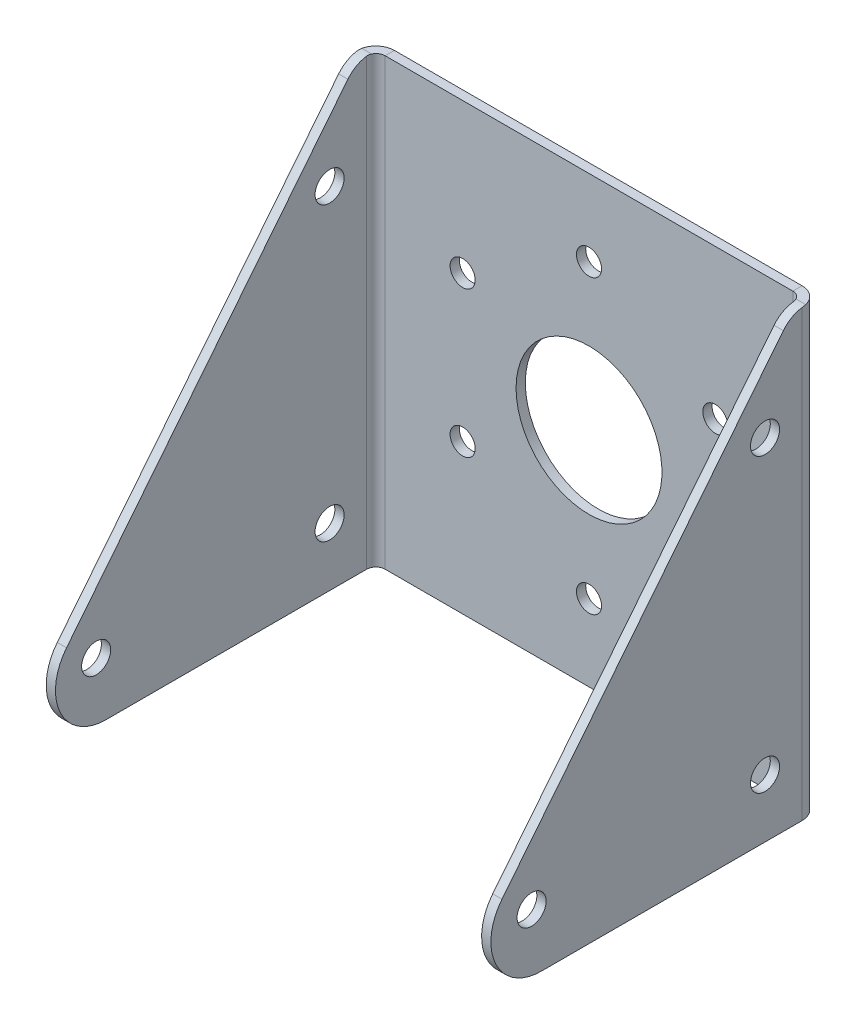
ISO-10303-21;
HEADER;
FILE_DESCRIPTION(('STEP AP214'),'2;1');
FILE_NAME('part.step','',(''),(''),'','','');
FILE_SCHEMA(('AUTOMOTIVE_DESIGN { 1 0 10303 214 1 1 1 1 }'));
ENDSEC;
DATA;
#1=APPLICATION_CONTEXT('core data for automotive mechanical design processes');
#2=APPLICATION_PROTOCOL_DEFINITION('international standard','automotive_design',2000,#1);
#3=PRODUCT_CONTEXT('',#1,'mechanical');
#4=PRODUCT('Part','Part','',(#3));
#5=PRODUCT_RELATED_PRODUCT_CATEGORY('part','',(#4));
#6=PRODUCT_DEFINITION_FORMATION('','',#4);
#7=PRODUCT_DEFINITION_CONTEXT('part definition',#1,'design');
#8=PRODUCT_DEFINITION('design','',#6,#7);
#9=PRODUCT_DEFINITION_SHAPE('','',#8);
#10=(LENGTH_UNIT() NAMED_UNIT(*) SI_UNIT(.MILLI.,.METRE.));
#11=(NAMED_UNIT(*) PLANE_ANGLE_UNIT() SI_UNIT($,.RADIAN.));
#12=(NAMED_UNIT(*) SI_UNIT($,.STERADIAN.) SOLID_ANGLE_UNIT());
#13=UNCERTAINTY_MEASURE_WITH_UNIT(LENGTH_MEASURE(1.E-05),#10,'distance_accuracy_value','');
#14=(GEOMETRIC_REPRESENTATION_CONTEXT(3) GLOBAL_UNCERTAINTY_ASSIGNED_CONTEXT((#13)) GLOBAL_UNIT_ASSIGNED_CONTEXT((#10,
#11,#12)) REPRESENTATION_CONTEXT('',''));
#15=CARTESIAN_POINT('',(0.,0.,0.));
#16=DIRECTION('',(0.,0.,1.));
#17=DIRECTION('',(1.,0.,0.));
#18=AXIS2_PLACEMENT_3D('',#15,#16,#17);
#19=CARTESIAN_POINT('',(-38.1000000000003,-38.1,78.4125));
#20=DIRECTION('',(0.,1.,0.));
#21=DIRECTION('',(0.,0.,1.));
#22=AXIS2_PLACEMENT_3D('',#19,#20,#21);
#23=PLANE('',#22);
#24=DIRECTION('',(-1.,0.,0.));
#25=VECTOR('',#24,1.);
#26=CARTESIAN_POINT('',(38.1000000000004,-38.1,46.2553130337973));
#27=LINE('',#26,#25);
#28=CARTESIAN_POINT('',(-36.5125000000002,-38.1,46.2553130337971));
#29=VERTEX_POINT('',#28);
#30=CARTESIAN_POINT('',(-38.1000000000002,-38.1,46.2553130337971));
#31=VERTEX_POINT('',#30);
#32=EDGE_CURVE('E277',#29,#31,#27,.T.);
#33=ORIENTED_EDGE('',*,*,#32,.T.);
#34=DIRECTION('',(0.,0.,1.));
#35=VECTOR('',#34,1.);
#36=CARTESIAN_POINT('',(-38.1,-38.1,-1.33661720332755E-13));
#37=LINE('',#36,#35);
#38=CARTESIAN_POINT('',(-38.1,-38.1,1.58749999999999));
#39=VERTEX_POINT('',#38);
#40=EDGE_CURVE('E367',#39,#31,#37,.T.);
#41=ORIENTED_EDGE('',*,*,#40,.F.);
#42=DIRECTION('',(1.,0.,0.));
#43=VECTOR('',#42,1.);
#44=CARTESIAN_POINT('',(-36.5125,-38.1,1.58749999999999));
#45=LINE('',#44,#43);
#46=CARTESIAN_POINT('',(-36.5125,-38.1,1.58749999999999));
#47=VERTEX_POINT('',#46);
#48=EDGE_CURVE('E380',#47,#39,#45,.F.);
#49=ORIENTED_EDGE('',*,*,#48,.F.);
#50=DIRECTION('',(0.,0.,-1.));
#51=VECTOR('',#50,1.);
#52=CARTESIAN_POINT('',(-36.5125000000003,-38.1,78.4125));
#53=LINE('',#52,#51);
#54=EDGE_CURVE('E372',#47,#29,#53,.F.);
#55=ORIENTED_EDGE('',*,*,#54,.T.);
#56=EDGE_LOOP('',(#33,#41,#49,#55));
#57=FACE_BOUND('',#56,.T.);
#58=ADVANCED_FACE('F140',(#57),#23,.F.);
#59=CARTESIAN_POINT('',(-38.1,0.,-1.37033272798737E-13));
#60=DIRECTION('',(1.,0.,0.));
#61=DIRECTION('',(0.,0.,-1.));
#62=AXIS2_PLACEMENT_3D('',#59,#60,#61);
#63=PLANE('',#62);
#64=CARTESIAN_POINT('',(-38.1,-28.1,7.93750000000003));
#65=DIRECTION('',(-1.,0.,0.));
#66=DIRECTION('',(0.,0.,1.));
#67=AXIS2_PLACEMENT_3D('',#64,#65,#66);
#68=CIRCLE('',#67,2.48919999999996);
#69=CARTESIAN_POINT('',(-38.1,-28.1,10.4267));
#70=VERTEX_POINT('',#69);
#71=EDGE_CURVE('E570',#70,#70,#68,.T.);
#72=ORIENTED_EDGE('',*,*,#71,.F.);
#73=EDGE_LOOP('',(#72));
#74=FACE_BOUND('',#73,.T.);
#75=DIRECTION('',(0.,-0.78086880944303,0.624695047554424));
#76=VECTOR('',#75,1.);
#77=CARTESIAN_POINT('',(-38.1000000000001,16.4788104920307,20.5985131150382));
#78=LINE('',#77,#76);
#79=CARTESIAN_POINT('',(-38.1,36.2234752377721,4.80278131844511));
#80=VERTEX_POINT('',#79);
#81=CARTESIAN_POINT('',(-38.1000000000002,-24.0394821908962,53.0131472613798));
#82=VERTEX_POINT('',#81);
#83=EDGE_CURVE('E291',#80,#82,#78,.T.);
#84=ORIENTED_EDGE('',*,*,#83,.F.);
#85=CARTESIAN_POINT('',(-38.1,33.1,0.898437271229962));
#86=DIRECTION('',(1.,0.,0.));
#87=DIRECTION('',(0.,0.,-1.));
#88=AXIS2_PLACEMENT_3D('',#85,#86,#87);
#89=CIRCLE('',#88,5.);
#90=CARTESIAN_POINT('',(-38.1,38.0522916468863,1.58749999999999));
#91=VERTEX_POINT('',#90);
#92=EDGE_CURVE('E450',#80,#91,#89,.F.);
#93=ORIENTED_EDGE('',*,*,#92,.T.);
#94=DIRECTION('',(0.,-1.,0.));
#95=VECTOR('',#94,1.);
#96=CARTESIAN_POINT('',(-38.1,38.1,1.58749999999999));
#97=LINE('',#96,#95);
#98=EDGE_CURVE('E376',#39,#91,#97,.F.);
#99=ORIENTED_EDGE('',*,*,#98,.F.);
#100=ORIENTED_EDGE('',*,*,#40,.T.);
#101=CARTESIAN_POINT('',(-38.1000000000002,-29.4457495729624,46.2553130337971));
#102=DIRECTION('',(-1.,0.,0.));
#103=DIRECTION('',(0.,0.,1.));
#104=AXIS2_PLACEMENT_3D('',#101,#102,#103);
#105=CIRCLE('',#104,8.65425042703763);
#106=EDGE_CURVE('E267',#82,#31,#105,.F.);
#107=ORIENTED_EDGE('',*,*,#106,.F.);
#108=EDGE_LOOP('',(#84,#93,#99,#100,#107));
#109=FACE_BOUND('',#108,.T.);
#110=CARTESIAN_POINT('',(-38.1,21.9,7.93750000000003));
#111=DIRECTION('',(-1.,0.,0.));
#112=DIRECTION('',(0.,0.,1.));
#113=AXIS2_PLACEMENT_3D('',#110,#111,#112);
#114=CIRCLE('',#113,2.48919999999996);
#115=CARTESIAN_POINT('',(-38.1,21.9,10.4267));
#116=VERTEX_POINT('',#115);
#117=EDGE_CURVE('E583',#116,#116,#114,.T.);
#118=ORIENTED_EDGE('',*,*,#117,.F.);
#119=EDGE_LOOP('',(#118));
#120=FACE_BOUND('',#119,.T.);
#121=CARTESIAN_POINT('',(-38.1000000000002,-28.1,47.9375));
#122=DIRECTION('',(-1.,0.,0.));
#123=DIRECTION('',(0.,0.,1.));
#124=AXIS2_PLACEMENT_3D('',#121,#122,#123);
#125=CIRCLE('',#124,2.48919999999997);
#126=CARTESIAN_POINT('',(-38.1000000000002,-28.1,50.4267));
#127=VERTEX_POINT('',#126);
#128=EDGE_CURVE('E571',#127,#127,#125,.T.);
#129=ORIENTED_EDGE('',*,*,#128,.F.);
#130=EDGE_LOOP('',(#129));
#131=FACE_BOUND('',#130,.T.);
#132=ADVANCED_FACE('F516',(#74,#109,#120,#131),#63,.F.);
#133=CARTESIAN_POINT('',(-36.5125,0.,-1.31490546173324E-13));
#134=DIRECTION('',(1.,0.,0.));
#135=DIRECTION('',(0.,0.,-1.));
#136=AXIS2_PLACEMENT_3D('',#133,#134,#135);
#137=PLANE('',#136);
#138=DIRECTION('',(0.,-1.,0.));
#139=VECTOR('',#138,1.);
#140=CARTESIAN_POINT('',(-36.5125,38.1,1.58749999999999));
#141=LINE('',#140,#139);
#142=CARTESIAN_POINT('',(-36.5125,38.0522916468863,1.58749999999999));
#143=VERTEX_POINT('',#142);
#144=EDGE_CURVE('E363',#143,#47,#141,.T.);
#145=ORIENTED_EDGE('',*,*,#144,.F.);
#146=CARTESIAN_POINT('',(-36.5125,33.1,0.898437271229968));
#147=DIRECTION('',(1.,0.,0.));
#148=DIRECTION('',(0.,0.,-1.));
#149=AXIS2_PLACEMENT_3D('',#146,#147,#148);
#150=CIRCLE('',#149,5.);
#151=CARTESIAN_POINT('',(-36.5125,36.2234752377721,4.80278131844512));
#152=VERTEX_POINT('',#151);
#153=EDGE_CURVE('E483',#143,#152,#150,.T.);
#154=ORIENTED_EDGE('',*,*,#153,.T.);
#155=DIRECTION('',(0.,0.78086880944303,-0.624695047554424));
#156=VECTOR('',#155,1.);
#157=CARTESIAN_POINT('',(-36.5125000000001,16.4788104920307,20.5985131150383));
#158=LINE('',#157,#156);
#159=CARTESIAN_POINT('',(-36.5125000000001,-24.0394821908962,53.0131472613798));
#160=VERTEX_POINT('',#159);
#161=EDGE_CURVE('E302',#160,#152,#158,.T.);
#162=ORIENTED_EDGE('',*,*,#161,.F.);
#163=CARTESIAN_POINT('',(-36.5125000000002,-29.4457495729624,46.2553130337971));
#164=DIRECTION('',(1.,0.,0.));
#165=DIRECTION('',(0.,0.,-1.));
#166=AXIS2_PLACEMENT_3D('',#163,#164,#165);
#167=CIRCLE('',#166,8.65425042703763);
#168=EDGE_CURVE('E298',#29,#160,#167,.F.);
#169=ORIENTED_EDGE('',*,*,#168,.F.);
#170=ORIENTED_EDGE('',*,*,#54,.F.);
#171=EDGE_LOOP('',(#145,#154,#162,#169,#170));
#172=FACE_BOUND('',#171,.T.);
#173=CARTESIAN_POINT('',(-36.5125,21.9,7.93750000000003));
#174=DIRECTION('',(1.,0.,0.));
#175=DIRECTION('',(0.,0.,-1.));
#176=AXIS2_PLACEMENT_3D('',#173,#174,#175);
#177=CIRCLE('',#176,2.48919999999996);
#178=CARTESIAN_POINT('',(-36.5125,21.9,5.44830000000007));
#179=VERTEX_POINT('',#178);
#180=EDGE_CURVE('E307',#179,#179,#177,.T.);
#181=ORIENTED_EDGE('',*,*,#180,.F.);
#182=EDGE_LOOP('',(#181));
#183=FACE_BOUND('',#182,.T.);
#184=CARTESIAN_POINT('',(-36.5125,-28.1,7.93750000000003));
#185=DIRECTION('',(1.,0.,0.));
#186=DIRECTION('',(0.,0.,-1.));
#187=AXIS2_PLACEMENT_3D('',#184,#185,#186);
#188=CIRCLE('',#187,2.48919999999996);
#189=CARTESIAN_POINT('',(-36.5125,-28.1,5.44830000000007));
#190=VERTEX_POINT('',#189);
#191=EDGE_CURVE('E312',#190,#190,#188,.T.);
#192=ORIENTED_EDGE('',*,*,#191,.F.);
#193=EDGE_LOOP('',(#192));
#194=FACE_BOUND('',#193,.T.);
#195=CARTESIAN_POINT('',(-36.5125000000002,-28.1,47.9375));
#196=DIRECTION('',(1.,0.,0.));
#197=DIRECTION('',(0.,0.,-1.));
#198=AXIS2_PLACEMENT_3D('',#195,#196,#197);
#199=CIRCLE('',#198,2.48919999999997);
#200=CARTESIAN_POINT('',(-36.5125000000002,-28.1,45.4483000000001));
#201=VERTEX_POINT('',#200);
#202=EDGE_CURVE('E317',#201,#201,#199,.T.);
#203=ORIENTED_EDGE('',*,*,#202,.F.);
#204=EDGE_LOOP('',(#203));
#205=FACE_BOUND('',#204,.T.);
#206=ADVANCED_FACE('F521',(#172,#183,#194,#205),#137,.T.);
#207=CARTESIAN_POINT('',(38.1,-38.1,0.));
#208=DIRECTION('',(0.,1.,0.));
#209=DIRECTION('',(0.,0.,1.));
#210=AXIS2_PLACEMENT_3D('',#207,#208,#209);
#211=PLANE('',#210);
#212=CARTESIAN_POINT('',(38.1000000000004,-38.1,46.2553130337973));
#213=VERTEX_POINT('',#212);
#214=CARTESIAN_POINT('',(36.5125000000002,-38.1,46.2553130337973));
#215=VERTEX_POINT('',#214);
#216=EDGE_CURVE('E282',#213,#215,#27,.T.);
#217=ORIENTED_EDGE('',*,*,#216,.T.);
#218=DIRECTION('',(0.,0.,1.));
#219=VECTOR('',#218,1.);
#220=CARTESIAN_POINT('',(36.5125,-38.1,0.));
#221=LINE('',#220,#219);
#222=CARTESIAN_POINT('',(36.5125,-38.1,1.58749999999999));
#223=VERTEX_POINT('',#222);
#224=EDGE_CURVE('E326',#215,#223,#221,.F.);
#225=ORIENTED_EDGE('',*,*,#224,.T.);
#226=DIRECTION('',(-1.,0.,0.));
#227=VECTOR('',#226,1.);
#228=CARTESIAN_POINT('',(38.1,-38.1,1.58749999999999));
#229=LINE('',#228,#227);
#230=CARTESIAN_POINT('',(38.1,-38.1,1.58749999999999));
#231=VERTEX_POINT('',#230);
#232=EDGE_CURVE('E321',#223,#231,#229,.F.);
#233=ORIENTED_EDGE('',*,*,#232,.T.);
#234=DIRECTION('',(0.,0.,-1.));
#235=VECTOR('',#234,1.);
#236=CARTESIAN_POINT('',(38.1,-38.1,-1.33661720332755E-13));
#237=LINE('',#236,#235);
#238=EDGE_CURVE('E322',#213,#231,#237,.T.);
#239=ORIENTED_EDGE('',*,*,#238,.F.);
#240=EDGE_LOOP('',(#217,#225,#233,#239));
#241=FACE_BOUND('',#240,.T.);
#242=ADVANCED_FACE('F527',(#241),#211,.F.);
#243=CARTESIAN_POINT('',(38.1,0.,-1.37033272798737E-13));
#244=DIRECTION('',(-1.,0.,0.));
#245=DIRECTION('',(0.,0.,1.));
#246=AXIS2_PLACEMENT_3D('',#243,#244,#245);
#247=PLANE('',#246);
#248=CARTESIAN_POINT('',(38.1000000000005,-28.1,7.93750000000029));
#249=DIRECTION('',(-1.,0.,0.));
#250=DIRECTION('',(0.,0.,1.));
#251=AXIS2_PLACEMENT_3D('',#248,#249,#250);
#252=CIRCLE('',#251,2.48919999999996);
#253=CARTESIAN_POINT('',(38.1000000000005,-28.1,10.4267000000003));
#254=VERTEX_POINT('',#253);
#255=EDGE_CURVE('E585',#254,#254,#252,.T.);
#256=ORIENTED_EDGE('',*,*,#255,.T.);
#257=EDGE_LOOP('',(#256));
#258=FACE_BOUND('',#257,.T.);
#259=DIRECTION('',(0.,1.,0.));
#260=VECTOR('',#259,1.);
#261=CARTESIAN_POINT('',(38.1,-38.1,1.58749999999999));
#262=LINE('',#261,#260);
#263=CARTESIAN_POINT('',(38.1,38.0522916468864,1.58749999999999));
#264=VERTEX_POINT('',#263);
#265=EDGE_CURVE('E328',#264,#231,#262,.F.);
#266=ORIENTED_EDGE('',*,*,#265,.F.);
#267=CARTESIAN_POINT('',(38.1,33.1,0.898437271230224));
#268=DIRECTION('',(-1.,0.,0.));
#269=DIRECTION('',(0.,0.,1.));
#270=AXIS2_PLACEMENT_3D('',#267,#268,#269);
#271=CIRCLE('',#270,5.);
#272=CARTESIAN_POINT('',(38.1000000000005,36.2234752377721,4.80278131844537));
#273=VERTEX_POINT('',#272);
#274=EDGE_CURVE('E13',#264,#273,#271,.F.);
#275=ORIENTED_EDGE('',*,*,#274,.T.);
#276=DIRECTION('',(0.,-0.78086880944303,0.624695047554424));
#277=VECTOR('',#276,1.);
#278=CARTESIAN_POINT('',(38.1000000000005,16.4788104920307,20.5985131150385));
#279=LINE('',#278,#277);
#280=CARTESIAN_POINT('',(38.1000000000004,-24.0394821908962,53.01314726138));
#281=VERTEX_POINT('',#280);
#282=EDGE_CURVE('E254',#273,#281,#279,.T.);
#283=ORIENTED_EDGE('',*,*,#282,.T.);
#284=CARTESIAN_POINT('',(38.1000000000004,-29.4457495729624,46.2553130337973));
#285=DIRECTION('',(-1.,0.,0.));
#286=DIRECTION('',(0.,0.,1.));
#287=AXIS2_PLACEMENT_3D('',#284,#285,#286);
#288=CIRCLE('',#287,8.65425042703763);
#289=EDGE_CURVE('E260',#281,#213,#288,.F.);
#290=ORIENTED_EDGE('',*,*,#289,.T.);
#291=ORIENTED_EDGE('',*,*,#238,.T.);
#292=EDGE_LOOP('',(#266,#275,#283,#290,#291));
#293=FACE_BOUND('',#292,.T.);
#294=CARTESIAN_POINT('',(38.1000000000005,21.9,7.93750000000029));
#295=DIRECTION('',(-1.,0.,0.));
#296=DIRECTION('',(0.,0.,1.));
#297=AXIS2_PLACEMENT_3D('',#294,#295,#296);
#298=CIRCLE('',#297,2.48919999999996);
#299=CARTESIAN_POINT('',(38.1000000000005,21.9,10.4267000000003));
#300=VERTEX_POINT('',#299);
#301=EDGE_CURVE('E294',#300,#300,#298,.T.);
#302=ORIENTED_EDGE('',*,*,#301,.T.);
#303=EDGE_LOOP('',(#302));
#304=FACE_BOUND('',#303,.T.);
#305=CARTESIAN_POINT('',(38.1000000000004,-28.1,47.9375000000003));
#306=DIRECTION('',(-1.,0.,0.));
#307=DIRECTION('',(0.,0.,1.));
#308=AXIS2_PLACEMENT_3D('',#305,#306,#307);
#309=CIRCLE('',#308,2.48919999999997);
#310=CARTESIAN_POINT('',(38.1000000000004,-28.1,50.4267000000003));
#311=VERTEX_POINT('',#310);
#312=EDGE_CURVE('E568',#311,#311,#309,.T.);
#313=ORIENTED_EDGE('',*,*,#312,.T.);
#314=EDGE_LOOP('',(#313));
#315=FACE_BOUND('',#314,.T.);
#316=ADVANCED_FACE('F256',(#258,#293,#304,#315),#247,.F.);
#317=CARTESIAN_POINT('',(36.5125,0.,-1.31490546173324E-13));
#318=DIRECTION('',(-1.,0.,0.));
#319=DIRECTION('',(0.,0.,1.));
#320=AXIS2_PLACEMENT_3D('',#317,#318,#319);
#321=PLANE('',#320);
#322=DIRECTION('',(0.,-0.78086880944303,0.624695047554424));
#323=VECTOR('',#322,1.);
#324=CARTESIAN_POINT('',(36.5125000000001,16.4788104920308,20.5985131150384));
#325=LINE('',#324,#323);
#326=CARTESIAN_POINT('',(36.5125,36.2234752377721,4.80278131844537));
#327=VERTEX_POINT('',#326);
#328=CARTESIAN_POINT('',(36.5125000000002,-24.0394821908961,53.01314726138));
#329=VERTEX_POINT('',#328);
#330=EDGE_CURVE('E273',#327,#329,#325,.T.);
#331=ORIENTED_EDGE('',*,*,#330,.F.);
#332=CARTESIAN_POINT('',(36.5125,33.1,0.898437271230219));
#333=DIRECTION('',(-1.,0.,0.));
#334=DIRECTION('',(0.,0.,1.));
#335=AXIS2_PLACEMENT_3D('',#332,#333,#334);
#336=CIRCLE('',#335,5.);
#337=CARTESIAN_POINT('',(36.5125,38.0522916468864,1.58749999999999));
#338=VERTEX_POINT('',#337);
#339=EDGE_CURVE('E553',#327,#338,#336,.T.);
#340=ORIENTED_EDGE('',*,*,#339,.T.);
#341=DIRECTION('',(0.,1.,0.));
#342=VECTOR('',#341,1.);
#343=CARTESIAN_POINT('',(36.5125,-38.1,1.58749999999999));
#344=LINE('',#343,#342);
#345=EDGE_CURVE('E331',#223,#338,#344,.T.);
#346=ORIENTED_EDGE('',*,*,#345,.F.);
#347=ORIENTED_EDGE('',*,*,#224,.F.);
#348=CARTESIAN_POINT('',(36.5125000000002,-29.4457495729624,46.2553130337973));
#349=DIRECTION('',(-1.,0.,0.));
#350=DIRECTION('',(0.,0.,1.));
#351=AXIS2_PLACEMENT_3D('',#348,#349,#350);
#352=CIRCLE('',#351,8.65425042703763);
#353=EDGE_CURVE('E426',#329,#215,#352,.F.);
#354=ORIENTED_EDGE('',*,*,#353,.F.);
#355=EDGE_LOOP('',(#331,#340,#346,#347,#354));
#356=FACE_BOUND('',#355,.T.);
#357=CARTESIAN_POINT('',(36.5125,21.9,7.93750000000029));
#358=DIRECTION('',(-1.,0.,0.));
#359=DIRECTION('',(0.,0.,1.));
#360=AXIS2_PLACEMENT_3D('',#357,#358,#359);
#361=CIRCLE('',#360,2.48919999999996);
#362=CARTESIAN_POINT('',(36.5125,21.9,10.4267000000003));
#363=VERTEX_POINT('',#362);
#364=EDGE_CURVE('E306',#363,#363,#361,.T.);
#365=ORIENTED_EDGE('',*,*,#364,.F.);
#366=EDGE_LOOP('',(#365));
#367=FACE_BOUND('',#366,.T.);
#368=CARTESIAN_POINT('',(36.5125,-28.1,7.93750000000029));
#369=DIRECTION('',(-1.,0.,0.));
#370=DIRECTION('',(0.,0.,1.));
#371=AXIS2_PLACEMENT_3D('',#368,#369,#370);
#372=CIRCLE('',#371,2.48919999999996);
#373=CARTESIAN_POINT('',(36.5125,-28.1,10.4267000000003));
#374=VERTEX_POINT('',#373);
#375=EDGE_CURVE('E311',#374,#374,#372,.T.);
#376=ORIENTED_EDGE('',*,*,#375,.F.);
#377=EDGE_LOOP('',(#376));
#378=FACE_BOUND('',#377,.T.);
#379=CARTESIAN_POINT('',(36.5125000000002,-28.1,47.9375000000003));
#380=DIRECTION('',(-1.,0.,0.));
#381=DIRECTION('',(0.,0.,1.));
#382=AXIS2_PLACEMENT_3D('',#379,#380,#381);
#383=CIRCLE('',#382,2.48919999999997);
#384=CARTESIAN_POINT('',(36.5125000000002,-28.1,50.4267000000003));
#385=VERTEX_POINT('',#384);
#386=EDGE_CURVE('E316',#385,#385,#383,.T.);
#387=ORIENTED_EDGE('',*,*,#386,.F.);
#388=EDGE_LOOP('',(#387));
#389=FACE_BOUND('',#388,.T.);
#390=ADVANCED_FACE('F504',(#356,#367,#378,#389),#321,.T.);
#391=CARTESIAN_POINT('',(0.,0.,-1.5875));
#392=DIRECTION('',(0.,0.,-1.));
#393=DIRECTION('',(-1.,0.,0.));
#394=AXIS2_PLACEMENT_3D('',#391,#392,#393);
#395=PLANE('',#394);
#396=CARTESIAN_POINT('',(21.6506350946108,12.5000000000003,-1.5875));
#397=DIRECTION('',(0.,0.,-1.));
#398=DIRECTION('',(-1.,0.,0.));
#399=AXIS2_PLACEMENT_3D('',#396,#397,#398);
#400=CIRCLE('',#399,2.15);
#401=CARTESIAN_POINT('',(19.5006350946108,12.5000000000003,-1.5875));
#402=VERTEX_POINT('',#401);
#403=EDGE_CURVE('E574',#402,#402,#400,.T.);
#404=ORIENTED_EDGE('',*,*,#403,.F.);
#405=EDGE_LOOP('',(#404));
#406=FACE_BOUND('',#405,.T.);
#407=CARTESIAN_POINT('',(21.6506350946111,-12.4999999999998,-1.5875));
#408=DIRECTION('',(0.,0.,-1.));
#409=DIRECTION('',(-1.,0.,0.));
#410=AXIS2_PLACEMENT_3D('',#407,#408,#409);
#411=CIRCLE('',#410,2.15);
#412=CARTESIAN_POINT('',(19.5006350946111,-12.4999999999998,-1.5875));
#413=VERTEX_POINT('',#412);
#414=EDGE_CURVE('E562',#413,#413,#411,.T.);
#415=ORIENTED_EDGE('',*,*,#414,.F.);
#416=EDGE_LOOP('',(#415));
#417=FACE_BOUND('',#416,.T.);
#418=CARTESIAN_POINT('',(0.,-25.,-1.5875));
#419=DIRECTION('',(0.,0.,-1.));
#420=DIRECTION('',(-1.,0.,0.));
#421=AXIS2_PLACEMENT_3D('',#418,#419,#420);
#422=CIRCLE('',#421,2.15);
#423=CARTESIAN_POINT('',(-2.15,-25.,-1.5875));
#424=VERTEX_POINT('',#423);
#425=EDGE_CURVE('E614',#424,#424,#422,.T.);
#426=ORIENTED_EDGE('',*,*,#425,.F.);
#427=EDGE_LOOP('',(#426));
#428=FACE_BOUND('',#427,.T.);
#429=CARTESIAN_POINT('',(-21.6506350946109,-12.5000000000001,-1.5875));
#430=DIRECTION('',(0.,0.,-1.));
#431=DIRECTION('',(-1.,0.,0.));
#432=AXIS2_PLACEMENT_3D('',#429,#430,#431);
#433=CIRCLE('',#432,2.15);
#434=CARTESIAN_POINT('',(-23.8006350946109,-12.5000000000001,-1.5875));
#435=VERTEX_POINT('',#434);
#436=EDGE_CURVE('E604',#435,#435,#433,.T.);
#437=ORIENTED_EDGE('',*,*,#436,.F.);
#438=EDGE_LOOP('',(#437));
#439=FACE_BOUND('',#438,.T.);
#440=CARTESIAN_POINT('',(-21.650635094611,12.5,-1.5875));
#441=DIRECTION('',(0.,0.,-1.));
#442=DIRECTION('',(-1.,0.,0.));
#443=AXIS2_PLACEMENT_3D('',#440,#441,#442);
#444=CIRCLE('',#443,2.15);
#445=CARTESIAN_POINT('',(-23.800635094611,12.5,-1.5875));
#446=VERTEX_POINT('',#445);
#447=EDGE_CURVE('E1048',#446,#446,#444,.T.);
#448=ORIENTED_EDGE('',*,*,#447,.F.);
#449=EDGE_LOOP('',(#448));
#450=FACE_BOUND('',#449,.T.);
#451=CARTESIAN_POINT('',(0.,25.,-1.5875));
#452=DIRECTION('',(0.,0.,-1.));
#453=DIRECTION('',(-1.,0.,0.));
#454=AXIS2_PLACEMENT_3D('',#451,#452,#453);
#455=CIRCLE('',#454,2.15);
#456=CARTESIAN_POINT('',(-2.15,25.,-1.5875));
#457=VERTEX_POINT('',#456);
#458=EDGE_CURVE('E599',#457,#457,#455,.T.);
#459=ORIENTED_EDGE('',*,*,#458,.F.);
#460=EDGE_LOOP('',(#459));
#461=FACE_BOUND('',#460,.T.);
#462=CARTESIAN_POINT('',(0.,0.,-1.5875));
#463=DIRECTION('',(0.,0.,-1.));
#464=DIRECTION('',(-1.,0.,0.));
#465=AXIS2_PLACEMENT_3D('',#462,#463,#464);
#466=CIRCLE('',#465,12.5);
#467=CARTESIAN_POINT('',(-12.5,0.,-1.5875));
#468=VERTEX_POINT('',#467);
#469=EDGE_CURVE('E598',#468,#468,#466,.T.);
#470=ORIENTED_EDGE('',*,*,#469,.F.);
#471=EDGE_LOOP('',(#470));
#472=FACE_BOUND('',#471,.T.);
#473=DIRECTION('',(-1.,0.,0.));
#474=VECTOR('',#473,1.);
#475=CARTESIAN_POINT('',(-38.1,38.1,-1.5875));
#476=LINE('',#475,#474);
#477=CARTESIAN_POINT('',(34.925,38.1,-1.5875));
#478=VERTEX_POINT('',#477);
#479=CARTESIAN_POINT('',(-34.925,38.1,-1.5875));
#480=VERTEX_POINT('',#479);
#481=EDGE_CURVE('E417',#478,#480,#476,.T.);
#482=ORIENTED_EDGE('',*,*,#481,.F.);
#483=DIRECTION('',(0.,1.,0.));
#484=VECTOR('',#483,1.);
#485=CARTESIAN_POINT('',(34.925,38.1,-1.5875));
#486=LINE('',#485,#484);
#487=CARTESIAN_POINT('',(34.925,-38.1,-1.5875));
#488=VERTEX_POINT('',#487);
#489=EDGE_CURVE('E338',#478,#488,#486,.F.);
#490=ORIENTED_EDGE('',*,*,#489,.T.);
#491=DIRECTION('',(1.,0.,0.));
#492=VECTOR('',#491,1.);
#493=CARTESIAN_POINT('',(-38.1,-38.1,-1.5875));
#494=LINE('',#493,#492);
#495=CARTESIAN_POINT('',(-34.925,-38.1,-1.5875));
#496=VERTEX_POINT('',#495);
#497=EDGE_CURVE('E421',#496,#488,#494,.T.);
#498=ORIENTED_EDGE('',*,*,#497,.F.);
#499=DIRECTION('',(0.,-1.,0.));
#500=VECTOR('',#499,1.);
#501=CARTESIAN_POINT('',(-34.925,-38.1,-1.5875));
#502=LINE('',#501,#500);
#503=EDGE_CURVE('E386',#496,#480,#502,.F.);
#504=ORIENTED_EDGE('',*,*,#503,.T.);
#505=EDGE_LOOP('',(#482,#490,#498,#504));
#506=FACE_BOUND('',#505,.T.);
#507=ADVANCED_FACE('F500',(#406,#417,#428,#439,#450,#461,#472,#506),#395,.T.);
#508=CARTESIAN_POINT('',(0.,0.,0.));
#509=DIRECTION('',(0.,0.,-1.));
#510=DIRECTION('',(-1.,0.,0.));
#511=AXIS2_PLACEMENT_3D('',#508,#509,#510);
#512=PLANE('',#511);
#513=CARTESIAN_POINT('',(21.6506350946108,12.5000000000003,0.));
#514=DIRECTION('',(0.,0.,-1.));
#515=DIRECTION('',(-1.,0.,0.));
#516=AXIS2_PLACEMENT_3D('',#513,#514,#515);
#517=CIRCLE('',#516,2.15);
#518=CARTESIAN_POINT('',(19.5006350946108,12.5000000000003,0.));
#519=VERTEX_POINT('',#518);
#520=EDGE_CURVE('E566',#519,#519,#517,.T.);
#521=ORIENTED_EDGE('',*,*,#520,.T.);
#522=EDGE_LOOP('',(#521));
#523=FACE_BOUND('',#522,.T.);
#524=CARTESIAN_POINT('',(21.6506350946111,-12.4999999999998,0.));
#525=DIRECTION('',(0.,0.,-1.));
#526=DIRECTION('',(-1.,0.,0.));
#527=AXIS2_PLACEMENT_3D('',#524,#525,#526);
#528=CIRCLE('',#527,2.15);
#529=CARTESIAN_POINT('',(19.5006350946111,-12.4999999999998,0.));
#530=VERTEX_POINT('',#529);
#531=EDGE_CURVE('E565',#530,#530,#528,.T.);
#532=ORIENTED_EDGE('',*,*,#531,.T.);
#533=EDGE_LOOP('',(#532));
#534=FACE_BOUND('',#533,.T.);
#535=CARTESIAN_POINT('',(0.,-25.,0.));
#536=DIRECTION('',(0.,0.,-1.));
#537=DIRECTION('',(-1.,0.,0.));
#538=AXIS2_PLACEMENT_3D('',#535,#536,#537);
#539=CIRCLE('',#538,2.15);
#540=CARTESIAN_POINT('',(-2.15,-25.,0.));
#541=VERTEX_POINT('',#540);
#542=EDGE_CURVE('E608',#541,#541,#539,.T.);
#543=ORIENTED_EDGE('',*,*,#542,.T.);
#544=EDGE_LOOP('',(#543));
#545=FACE_BOUND('',#544,.T.);
#546=CARTESIAN_POINT('',(-21.6506350946109,-12.5000000000001,0.));
#547=DIRECTION('',(0.,0.,-1.));
#548=DIRECTION('',(-1.,0.,0.));
#549=AXIS2_PLACEMENT_3D('',#546,#547,#548);
#550=CIRCLE('',#549,2.15);
#551=CARTESIAN_POINT('',(-23.8006350946109,-12.5000000000001,0.));
#552=VERTEX_POINT('',#551);
#553=EDGE_CURVE('E607',#552,#552,#550,.T.);
#554=ORIENTED_EDGE('',*,*,#553,.T.);
#555=EDGE_LOOP('',(#554));
#556=FACE_BOUND('',#555,.T.);
#557=CARTESIAN_POINT('',(-21.650635094611,12.5,0.));
#558=DIRECTION('',(0.,0.,-1.));
#559=DIRECTION('',(-1.,0.,0.));
#560=AXIS2_PLACEMENT_3D('',#557,#558,#559);
#561=CIRCLE('',#560,2.15);
#562=CARTESIAN_POINT('',(-23.800635094611,12.5,0.));
#563=VERTEX_POINT('',#562);
#564=EDGE_CURVE('E1045',#563,#563,#561,.T.);
#565=ORIENTED_EDGE('',*,*,#564,.T.);
#566=EDGE_LOOP('',(#565));
#567=FACE_BOUND('',#566,.T.);
#568=CARTESIAN_POINT('',(0.,25.,0.));
#569=DIRECTION('',(0.,0.,-1.));
#570=DIRECTION('',(-1.,0.,0.));
#571=AXIS2_PLACEMENT_3D('',#568,#569,#570);
#572=CIRCLE('',#571,2.15);
#573=CARTESIAN_POINT('',(-2.15,25.,0.));
#574=VERTEX_POINT('',#573);
#575=EDGE_CURVE('E595',#574,#574,#572,.T.);
#576=ORIENTED_EDGE('',*,*,#575,.T.);
#577=EDGE_LOOP('',(#576));
#578=FACE_BOUND('',#577,.T.);
#579=CARTESIAN_POINT('',(0.,0.,0.));
#580=DIRECTION('',(0.,0.,-1.));
#581=DIRECTION('',(-1.,0.,0.));
#582=AXIS2_PLACEMENT_3D('',#579,#580,#581);
#583=CIRCLE('',#582,12.5);
#584=CARTESIAN_POINT('',(-12.5,0.,0.));
#585=VERTEX_POINT('',#584);
#586=EDGE_CURVE('E590',#585,#585,#583,.F.);
#587=ORIENTED_EDGE('',*,*,#586,.F.);
#588=EDGE_LOOP('',(#587));
#589=FACE_BOUND('',#588,.T.);
#590=DIRECTION('',(0.,1.,0.));
#591=VECTOR('',#590,1.);
#592=CARTESIAN_POINT('',(34.925,38.1,0.));
#593=LINE('',#592,#591);
#594=CARTESIAN_POINT('',(34.925,38.1,0.));
#595=VERTEX_POINT('',#594);
#596=CARTESIAN_POINT('',(34.925,-38.1,0.));
#597=VERTEX_POINT('',#596);
#598=EDGE_CURVE('E354',#595,#597,#593,.F.);
#599=ORIENTED_EDGE('',*,*,#598,.F.);
#600=DIRECTION('',(-1.,0.,0.));
#601=VECTOR('',#600,1.);
#602=CARTESIAN_POINT('',(-38.1,38.1,0.));
#603=LINE('',#602,#601);
#604=CARTESIAN_POINT('',(-34.925,38.1,0.));
#605=VERTEX_POINT('',#604);
#606=EDGE_CURVE('E413',#595,#605,#603,.T.);
#607=ORIENTED_EDGE('',*,*,#606,.T.);
#608=DIRECTION('',(0.,-1.,0.));
#609=VECTOR('',#608,1.);
#610=CARTESIAN_POINT('',(-34.925,-38.1,0.));
#611=LINE('',#610,#609);
#612=CARTESIAN_POINT('',(-34.925,-38.1,0.));
#613=VERTEX_POINT('',#612);
#614=EDGE_CURVE('E403',#613,#605,#611,.F.);
#615=ORIENTED_EDGE('',*,*,#614,.F.);
#616=DIRECTION('',(1.,0.,0.));
#617=VECTOR('',#616,1.);
#618=CARTESIAN_POINT('',(-38.1,-38.1,0.));
#619=LINE('',#618,#617);
#620=EDGE_CURVE('E422',#613,#597,#619,.T.);
#621=ORIENTED_EDGE('',*,*,#620,.T.);
#622=EDGE_LOOP('',(#599,#607,#615,#621));
#623=FACE_BOUND('',#622,.T.);
#624=ADVANCED_FACE('F503',(#523,#534,#545,#556,#567,#578,#589,#623),#512,.F.);
#625=CARTESIAN_POINT('',(-38.1,38.1,-1.5875));
#626=DIRECTION('',(0.,1.,0.));
#627=DIRECTION('',(0.,0.,1.));
#628=AXIS2_PLACEMENT_3D('',#625,#626,#627);
#629=PLANE('',#628);
#630=ORIENTED_EDGE('',*,*,#606,.F.);
#631=DIRECTION('',(0.,0.,-1.));
#632=VECTOR('',#631,1.);
#633=CARTESIAN_POINT('',(34.925,38.1,0.));
#634=LINE('',#633,#632);
#635=EDGE_CURVE('E347',#595,#478,#634,.T.);
#636=ORIENTED_EDGE('',*,*,#635,.T.);
#637=ORIENTED_EDGE('',*,*,#481,.T.);
#638=DIRECTION('',(0.,0.,-1.));
#639=VECTOR('',#638,1.);
#640=CARTESIAN_POINT('',(-34.925,38.1,0.));
#641=LINE('',#640,#639);
#642=EDGE_CURVE('E409',#605,#480,#641,.T.);
#643=ORIENTED_EDGE('',*,*,#642,.F.);
#644=EDGE_LOOP('',(#630,#636,#637,#643));
#645=FACE_BOUND('',#644,.T.);
#646=ADVANCED_FACE('F473',(#645),#629,.T.);
#647=CARTESIAN_POINT('',(-38.1,-38.1,-1.5875));
#648=DIRECTION('',(0.,-1.,0.));
#649=DIRECTION('',(0.,0.,-1.));
#650=AXIS2_PLACEMENT_3D('',#647,#648,#649);
#651=PLANE('',#650);
#652=DIRECTION('',(0.,0.,-1.));
#653=VECTOR('',#652,1.);
#654=CARTESIAN_POINT('',(34.925,-38.1,0.));
#655=LINE('',#654,#653);
#656=EDGE_CURVE('E359',#597,#488,#655,.T.);
#657=ORIENTED_EDGE('',*,*,#656,.F.);
#658=ORIENTED_EDGE('',*,*,#620,.F.);
#659=DIRECTION('',(0.,0.,-1.));
#660=VECTOR('',#659,1.);
#661=CARTESIAN_POINT('',(-34.925,-38.1,0.));
#662=LINE('',#661,#660);
#663=EDGE_CURVE('E395',#613,#496,#662,.T.);
#664=ORIENTED_EDGE('',*,*,#663,.T.);
#665=ORIENTED_EDGE('',*,*,#497,.T.);
#666=EDGE_LOOP('',(#657,#658,#664,#665));
#667=FACE_BOUND('',#666,.T.);
#668=ADVANCED_FACE('F495',(#667),#651,.T.);
#669=CARTESIAN_POINT('',(-34.925,38.1,1.5875));
#670=DIRECTION('',(0.,1.,0.));
#671=DIRECTION('',(0.,0.,1.));
#672=AXIS2_PLACEMENT_3D('',#669,#670,#671);
#673=PLANE('',#672);
#674=CARTESIAN_POINT('',(-34.925,38.1,1.5875));
#675=DIRECTION('',(0.,-1.,0.));
#676=DIRECTION('',(0.,0.,-1.));
#677=AXIS2_PLACEMENT_3D('',#674,#675,#676);
#678=CIRCLE('',#677,3.175);
#679=CARTESIAN_POINT('',(-38.0243253388149,38.1,0.898437271229963));
#680=VERTEX_POINT('',#679);
#681=EDGE_CURVE('E390',#480,#680,#678,.F.);
#682=ORIENTED_EDGE('',*,*,#681,.T.);
#683=DIRECTION('',(-1.,0.,0.));
#684=VECTOR('',#683,1.);
#685=CARTESIAN_POINT('',(-36.5125000000001,38.1,0.898437271229968));
#686=LINE('',#685,#684);
#687=CARTESIAN_POINT('',(-36.3551569165025,38.1,0.898437271229969));
#688=VERTEX_POINT('',#687);
#689=EDGE_CURVE('E461',#680,#688,#686,.F.);
#690=ORIENTED_EDGE('',*,*,#689,.T.);
#691=CARTESIAN_POINT('',(-34.925,38.1,1.5875));
#692=DIRECTION('',(0.,-1.,0.));
#693=DIRECTION('',(0.,0.,-1.));
#694=AXIS2_PLACEMENT_3D('',#691,#692,#693);
#695=CIRCLE('',#694,1.5875);
#696=EDGE_CURVE('E399',#605,#688,#695,.F.);
#697=ORIENTED_EDGE('',*,*,#696,.F.);
#698=ORIENTED_EDGE('',*,*,#642,.T.);
#699=EDGE_LOOP('',(#682,#690,#697,#698));
#700=FACE_BOUND('',#699,.T.);
#701=ADVANCED_FACE('F491',(#700),#673,.T.);
#702=CARTESIAN_POINT('',(-34.925,-38.1,1.5875));
#703=DIRECTION('',(0.,1.,0.));
#704=DIRECTION('',(0.,0.,1.));
#705=AXIS2_PLACEMENT_3D('',#702,#703,#704);
#706=PLANE('',#705);
#707=CARTESIAN_POINT('',(-34.925,-38.1,1.5875));
#708=DIRECTION('',(0.,-1.,0.));
#709=DIRECTION('',(0.,0.,-1.));
#710=AXIS2_PLACEMENT_3D('',#707,#708,#709);
#711=CIRCLE('',#710,1.5875);
#712=EDGE_CURVE('E371',#47,#613,#711,.T.);
#713=ORIENTED_EDGE('',*,*,#712,.F.);
#714=ORIENTED_EDGE('',*,*,#48,.T.);
#715=CARTESIAN_POINT('',(-34.925,-38.1,1.5875));
#716=DIRECTION('',(0.,-1.,0.));
#717=DIRECTION('',(0.,0.,-1.));
#718=AXIS2_PLACEMENT_3D('',#715,#716,#717);
#719=CIRCLE('',#718,3.175);
#720=EDGE_CURVE('E391',#39,#496,#719,.T.);
#721=ORIENTED_EDGE('',*,*,#720,.T.);
#722=ORIENTED_EDGE('',*,*,#663,.F.);
#723=EDGE_LOOP('',(#713,#714,#721,#722));
#724=FACE_BOUND('',#723,.T.);
#725=ADVANCED_FACE('F494',(#724),#706,.F.);
#726=CARTESIAN_POINT('',(-34.925,-38.1,1.5875));
#727=DIRECTION('',(0.,-1.,0.));
#728=DIRECTION('',(-1.,0.,0.));
#729=AXIS2_PLACEMENT_3D('',#726,#727,#728);
#730=CYLINDRICAL_SURFACE('',#729,3.175);
#731=ORIENTED_EDGE('',*,*,#98,.T.);
#732=CARTESIAN_POINT('',(-38.1,38.0522916468863,1.58749999999999));
#733=CARTESIAN_POINT('',(-38.1000041964783,38.0603148462725,1.52986977498726));
#734=CARTESIAN_POINT('',(-38.0984308893546,38.0673233260436,1.47209735175716));
#735=CARTESIAN_POINT('',(-38.0921276478144,38.0792851427486,1.35675593090946));
#736=CARTESIAN_POINT('',(-38.0874108798638,38.0842469126219,1.29918708749888));
#737=CARTESIAN_POINT('',(-38.0748193219421,38.0921563749844,1.1842567836071));
#738=CARTESIAN_POINT('',(-38.0669445321039,38.0951040675584,1.12689532311716));
#739=CARTESIAN_POINT('',(-38.0480201379789,38.0990321767662,1.01238377021696));
#740=CARTESIAN_POINT('',(-38.0369574009808,38.1000043189535,0.955235563473965));
#741=CARTESIAN_POINT('',(-38.0243253388149,38.1,0.898437271229963));
#742=B_SPLINE_CURVE_WITH_KNOTS('',3,(#732,#733,#734,#735,#736,#737,#738,#739,#740,#741),
.UNSPECIFIED.,.F.,.F.,(4,2,2,2,4),(0.,0.174529182071602,0.348331900472409,0.522134611561614,
0.696663794413843),.UNSPECIFIED.);
#743=EDGE_CURVE('E453',#91,#680,#742,.T.);
#744=ORIENTED_EDGE('',*,*,#743,.T.);
#745=ORIENTED_EDGE('',*,*,#681,.F.);
#746=ORIENTED_EDGE('',*,*,#503,.F.);
#747=ORIENTED_EDGE('',*,*,#720,.F.);
#748=EDGE_LOOP('',(#731,#744,#745,#746,#747));
#749=FACE_BOUND('',#748,.T.);
#750=ADVANCED_FACE('F463',(#749),#730,.T.);
#751=CARTESIAN_POINT('',(-34.925,-38.1,1.5875));
#752=DIRECTION('',(0.,-1.,0.));
#753=DIRECTION('',(-1.,0.,0.));
#754=AXIS2_PLACEMENT_3D('',#751,#752,#753);
#755=CYLINDRICAL_SURFACE('',#754,1.5875);
#756=ORIENTED_EDGE('',*,*,#696,.T.);
#757=CARTESIAN_POINT('',(-36.3551569165025,38.1,0.898437271229969));
#758=CARTESIAN_POINT('',(-36.3739652923782,38.100001063723,0.937477927950012));
#759=CARTESIAN_POINT('',(-36.3911644238206,38.0995417893741,0.977263641262893));
#760=CARTESIAN_POINT('',(-36.4222560290201,38.0976138825675,1.05810298616054));
#761=CARTESIAN_POINT('',(-36.4361470286696,38.0961448012676,1.09915717380802));
#762=CARTESIAN_POINT('',(-36.4722029986464,38.0901729800984,1.22213217010712));
#763=CARTESIAN_POINT('',(-36.4895271886271,38.0841120451187,1.30548683816724));
#764=CARTESIAN_POINT('',(-36.5042151212853,38.072607009659,1.42215626273244));
#765=CARTESIAN_POINT('',(-36.5073099478875,38.069032850958,1.45504809831988));
#766=CARTESIAN_POINT('',(-36.5114590627528,38.0611851789231,1.52113551225548));
#767=CARTESIAN_POINT('',(-36.5124974282852,38.0569064841114,1.55433147662936));
#768=CARTESIAN_POINT('',(-36.5125,38.0522916468863,1.58749999999999));
#769=B_SPLINE_CURVE_WITH_KNOTS('',3,(#757,#758,#759,#760,#761,#762,#763,#764,#765,#766,#767,
#768),.UNSPECIFIED.,.F.,.F.,(4,2,2,2,2,4),(0.,0.12991106496132,0.259879910585832,
0.514490504930676,0.61412951768686,0.714537043580251),.UNSPECIFIED.);
#770=EDGE_CURVE('E476',#688,#143,#769,.T.);
#771=ORIENTED_EDGE('',*,*,#770,.T.);
#772=ORIENTED_EDGE('',*,*,#144,.T.);
#773=ORIENTED_EDGE('',*,*,#712,.T.);
#774=ORIENTED_EDGE('',*,*,#614,.T.);
#775=EDGE_LOOP('',(#756,#771,#772,#773,#774));
#776=FACE_BOUND('',#775,.T.);
#777=ADVANCED_FACE('F485',(#776),#755,.F.);
#778=CARTESIAN_POINT('',(34.925,-38.1,1.5875));
#779=DIRECTION('',(0.,-1.,0.));
#780=DIRECTION('',(0.,0.,-1.));
#781=AXIS2_PLACEMENT_3D('',#778,#779,#780);
#782=PLANE('',#781);
#783=ORIENTED_EDGE('',*,*,#232,.F.);
#784=CARTESIAN_POINT('',(34.925,-38.1,1.5875));
#785=DIRECTION('',(0.,1.,0.));
#786=DIRECTION('',(0.,0.,1.));
#787=AXIS2_PLACEMENT_3D('',#784,#785,#786);
#788=CIRCLE('',#787,1.5875);
#789=EDGE_CURVE('E350',#597,#223,#788,.F.);
#790=ORIENTED_EDGE('',*,*,#789,.F.);
#791=ORIENTED_EDGE('',*,*,#656,.T.);
#792=CARTESIAN_POINT('',(34.925,-38.1,1.5875));
#793=DIRECTION('',(0.,1.,0.));
#794=DIRECTION('',(0.,0.,1.));
#795=AXIS2_PLACEMENT_3D('',#792,#793,#794);
#796=CIRCLE('',#795,3.175);
#797=EDGE_CURVE('E342',#488,#231,#796,.F.);
#798=ORIENTED_EDGE('',*,*,#797,.T.);
#799=EDGE_LOOP('',(#783,#790,#791,#798));
#800=FACE_BOUND('',#799,.T.);
#801=ADVANCED_FACE('F489',(#800),#782,.T.);
#802=CARTESIAN_POINT('',(34.925,38.1,1.5875));
#803=DIRECTION('',(0.,-1.,0.));
#804=DIRECTION('',(0.,0.,-1.));
#805=AXIS2_PLACEMENT_3D('',#802,#803,#804);
#806=PLANE('',#805);
#807=CARTESIAN_POINT('',(34.925,38.1,1.5875));
#808=DIRECTION('',(0.,1.,0.));
#809=DIRECTION('',(0.,0.,1.));
#810=AXIS2_PLACEMENT_3D('',#807,#808,#809);
#811=CIRCLE('',#810,1.5875);
#812=CARTESIAN_POINT('',(36.3551569165026,38.1,0.898437271230218));
#813=VERTEX_POINT('',#812);
#814=EDGE_CURVE('E325',#813,#595,#811,.T.);
#815=ORIENTED_EDGE('',*,*,#814,.F.);
#816=DIRECTION('',(-1.,0.,0.));
#817=VECTOR('',#816,1.);
#818=CARTESIAN_POINT('',(38.1000000000005,38.1,0.898437271230224));
#819=LINE('',#818,#817);
#820=CARTESIAN_POINT('',(38.0243253388149,38.1,0.898437271230224));
#821=VERTEX_POINT('',#820);
#822=EDGE_CURVE('E164',#813,#821,#819,.F.);
#823=ORIENTED_EDGE('',*,*,#822,.T.);
#824=CARTESIAN_POINT('',(34.925,38.1,1.5875));
#825=DIRECTION('',(0.,1.,0.));
#826=DIRECTION('',(0.,0.,1.));
#827=AXIS2_PLACEMENT_3D('',#824,#825,#826);
#828=CIRCLE('',#827,3.175);
#829=EDGE_CURVE('E343',#821,#478,#828,.T.);
#830=ORIENTED_EDGE('',*,*,#829,.T.);
#831=ORIENTED_EDGE('',*,*,#635,.F.);
#832=EDGE_LOOP('',(#815,#823,#830,#831));
#833=FACE_BOUND('',#832,.T.);
#834=ADVANCED_FACE('F530',(#833),#806,.F.);
#835=CARTESIAN_POINT('',(34.925,38.1,1.5875));
#836=DIRECTION('',(0.,1.,0.));
#837=DIRECTION('',(1.,0.,0.));
#838=AXIS2_PLACEMENT_3D('',#835,#836,#837);
#839=CYLINDRICAL_SURFACE('',#838,3.175);
#840=ORIENTED_EDGE('',*,*,#829,.F.);
#841=CARTESIAN_POINT('',(38.0243253388149,38.1,0.898437271230224));
#842=CARTESIAN_POINT('',(38.0369574009809,38.1000043189535,0.955235563474206));
#843=CARTESIAN_POINT('',(38.0480201379789,38.0990321767662,1.01238377021718));
#844=CARTESIAN_POINT('',(38.0669445321039,38.0951040675584,1.12689532311734));
#845=CARTESIAN_POINT('',(38.0748193219421,38.0921563749844,1.18425678360725));
#846=CARTESIAN_POINT('',(38.0874108798638,38.0842469126219,1.29918708749899));
#847=CARTESIAN_POINT('',(38.0921276478144,38.0792851427486,1.35675593090954));
#848=CARTESIAN_POINT('',(38.0984308893546,38.0673233260437,1.4720973517572));
#849=CARTESIAN_POINT('',(38.1000041964783,38.0603148462725,1.52986977498728));
#850=CARTESIAN_POINT('',(38.1,38.0522916468864,1.58749999999999));
#851=B_SPLINE_CURVE_WITH_KNOTS('',3,(#841,#842,#843,#844,#845,#846,#847,#848,#849,#850),
.UNSPECIFIED.,.F.,.F.,(4,2,2,2,4),(0.,0.174529182852161,0.3483318939413,0.52213461234204,
0.696663794413574),.UNSPECIFIED.);
#852=EDGE_CURVE('E150',#821,#264,#851,.T.);
#853=ORIENTED_EDGE('',*,*,#852,.T.);
#854=ORIENTED_EDGE('',*,*,#265,.T.);
#855=ORIENTED_EDGE('',*,*,#797,.F.);
#856=ORIENTED_EDGE('',*,*,#489,.F.);
#857=EDGE_LOOP('',(#840,#853,#854,#855,#856));
#858=FACE_BOUND('',#857,.T.);
#859=ADVANCED_FACE('F533',(#858),#839,.T.);
#860=CARTESIAN_POINT('',(34.925,38.1,1.5875));
#861=DIRECTION('',(0.,1.,0.));
#862=DIRECTION('',(1.,0.,0.));
#863=AXIS2_PLACEMENT_3D('',#860,#861,#862);
#864=CYLINDRICAL_SURFACE('',#863,1.5875);
#865=ORIENTED_EDGE('',*,*,#345,.T.);
#866=CARTESIAN_POINT('',(36.5125,38.0522916468864,1.58749999999999));
#867=CARTESIAN_POINT('',(36.5124985315771,38.0582659968906,1.5445788562956));
#868=CARTESIAN_POINT('',(36.510757342276,38.0636732320807,1.50160603615855));
#869=CARTESIAN_POINT('',(36.5037756871642,38.0733491478896,1.41579794338504));
#870=CARTESIAN_POINT('',(36.4985336841023,38.0776173271818,1.37296273948408));
#871=CARTESIAN_POINT('',(36.4778158483707,38.0885482878915,1.24682868930664));
#872=CARTESIAN_POINT('',(36.4573467391903,38.093581983043,1.1641209863884));
#873=CARTESIAN_POINT('',(36.4198786667179,38.0977376981146,1.05214422942808));
#874=CARTESIAN_POINT('',(36.4083507378279,38.0985930999183,1.02098977853466));
#875=CARTESIAN_POINT('',(36.3832640199197,38.0997261975353,0.959218349613083));
#876=CARTESIAN_POINT('',(36.3696902540553,38.0999993870533,0.928607369746304));
#877=CARTESIAN_POINT('',(36.3551569165027,38.1,0.898437271230216));
#878=B_SPLINE_CURVE_WITH_KNOTS('',3,(#866,#867,#868,#869,#870,#871,#872,#873,#874,#875,#876,
#877),.UNSPECIFIED.,.F.,.F.,(4,2,2,2,2,4),(0.,0.129911201972414,0.259879487125469,
0.514490640778749,0.614129647093838,0.714537095012404),.UNSPECIFIED.);
#879=EDGE_CURVE('E545',#338,#813,#878,.T.);
#880=ORIENTED_EDGE('',*,*,#879,.T.);
#881=ORIENTED_EDGE('',*,*,#814,.T.);
#882=ORIENTED_EDGE('',*,*,#598,.T.);
#883=ORIENTED_EDGE('',*,*,#789,.T.);
#884=EDGE_LOOP('',(#865,#880,#881,#882,#883));
#885=FACE_BOUND('',#884,.T.);
#886=ADVANCED_FACE('F537',(#885),#864,.F.);
#887=CARTESIAN_POINT('',(38.1000000000004,-29.4457495729624,46.2553130337973));
#888=DIRECTION('',(-1.,0.,0.));
#889=DIRECTION('',(0.,0.,1.));
#890=AXIS2_PLACEMENT_3D('',#887,#888,#889);
#891=CYLINDRICAL_SURFACE('',#890,8.65425042703763);
#892=ORIENTED_EDGE('',*,*,#353,.T.);
#893=ORIENTED_EDGE('',*,*,#216,.F.);
#894=ORIENTED_EDGE('',*,*,#289,.F.);
#895=DIRECTION('',(-1.,0.,0.));
#896=VECTOR('',#895,1.);
#897=CARTESIAN_POINT('',(38.1000000000004,-24.0394821908962,53.01314726138));
#898=LINE('',#897,#896);
#899=EDGE_CURVE('E270',#281,#329,#898,.T.);
#900=ORIENTED_EDGE('',*,*,#899,.T.);
#901=EDGE_LOOP('',(#892,#893,#894,#900));
#902=FACE_BOUND('',#901,.T.);
#903=ADVANCED_FACE('F280',(#902),#891,.T.);
#904=CARTESIAN_POINT('',(38.1000000000005,16.4788104920307,20.5985131150385));
#905=DIRECTION('',(0.,-0.624695047554424,-0.78086880944303));
#906=DIRECTION('',(0.,0.78086880944303,-0.624695047554424));
#907=AXIS2_PLACEMENT_3D('',#904,#905,#906);
#908=PLANE('',#907);
#909=ORIENTED_EDGE('',*,*,#282,.F.);
#910=DIRECTION('',(1.,0.,0.));
#911=VECTOR('',#910,1.);
#912=CARTESIAN_POINT('',(36.5125000000001,36.2234752377721,4.80278131844537));
#913=LINE('',#912,#911);
#914=EDGE_CURVE('E592',#273,#327,#913,.F.);
#915=ORIENTED_EDGE('',*,*,#914,.T.);
#916=ORIENTED_EDGE('',*,*,#330,.T.);
#917=ORIENTED_EDGE('',*,*,#899,.F.);
#918=EDGE_LOOP('',(#909,#915,#916,#917));
#919=FACE_BOUND('',#918,.T.);
#920=ADVANCED_FACE('F271',(#919),#908,.F.);
#921=CARTESIAN_POINT('',(38.1000000000005,21.9,7.93750000000029));
#922=DIRECTION('',(-1.,0.,0.));
#923=DIRECTION('',(0.,0.,1.));
#924=AXIS2_PLACEMENT_3D('',#921,#922,#923);
#925=CYLINDRICAL_SURFACE('',#924,2.48919999999996);
#926=ORIENTED_EDGE('',*,*,#364,.T.);
#927=EDGE_LOOP('',(#926));
#928=FACE_BOUND('',#927,.T.);
#929=ORIENTED_EDGE('',*,*,#301,.F.);
#930=EDGE_LOOP('',(#929));
#931=FACE_BOUND('',#930,.T.);
#932=ADVANCED_FACE('F703',(#928,#931),#925,.F.);
#933=CARTESIAN_POINT('',(38.1000000000005,-28.1,7.93750000000029));
#934=DIRECTION('',(-1.,0.,0.));
#935=DIRECTION('',(0.,0.,1.));
#936=AXIS2_PLACEMENT_3D('',#933,#934,#935);
#937=CYLINDRICAL_SURFACE('',#936,2.48919999999996);
#938=ORIENTED_EDGE('',*,*,#375,.T.);
#939=EDGE_LOOP('',(#938));
#940=FACE_BOUND('',#939,.T.);
#941=ORIENTED_EDGE('',*,*,#255,.F.);
#942=EDGE_LOOP('',(#941));
#943=FACE_BOUND('',#942,.T.);
#944=ADVANCED_FACE('F695',(#940,#943),#937,.F.);
#945=CARTESIAN_POINT('',(38.1000000000004,-28.1,47.9375000000003));
#946=DIRECTION('',(-1.,0.,0.));
#947=DIRECTION('',(0.,0.,1.));
#948=AXIS2_PLACEMENT_3D('',#945,#946,#947);
#949=CYLINDRICAL_SURFACE('',#948,2.48919999999997);
#950=ORIENTED_EDGE('',*,*,#386,.T.);
#951=EDGE_LOOP('',(#950));
#952=FACE_BOUND('',#951,.T.);
#953=ORIENTED_EDGE('',*,*,#312,.F.);
#954=EDGE_LOOP('',(#953));
#955=FACE_BOUND('',#954,.T.);
#956=ADVANCED_FACE('F687',(#952,#955),#949,.F.);
#957=ORIENTED_EDGE('',*,*,#161,.T.);
#958=DIRECTION('',(-1.,0.,0.));
#959=VECTOR('',#958,1.);
#960=CARTESIAN_POINT('',(-38.1,36.2234752377721,4.80278131844512));
#961=LINE('',#960,#959);
#962=EDGE_CURVE('E437',#152,#80,#961,.T.);
#963=ORIENTED_EDGE('',*,*,#962,.T.);
#964=ORIENTED_EDGE('',*,*,#83,.T.);
#965=EDGE_CURVE('E278',#160,#82,#898,.T.);
#966=ORIENTED_EDGE('',*,*,#965,.F.);
#967=EDGE_LOOP('',(#957,#963,#964,#966));
#968=FACE_BOUND('',#967,.T.);
#969=ADVANCED_FACE('F708',(#968),#908,.F.);
#970=ORIENTED_EDGE('',*,*,#168,.T.);
#971=ORIENTED_EDGE('',*,*,#965,.T.);
#972=ORIENTED_EDGE('',*,*,#106,.T.);
#973=ORIENTED_EDGE('',*,*,#32,.F.);
#974=EDGE_LOOP('',(#970,#971,#972,#973));
#975=FACE_BOUND('',#974,.T.);
#976=ADVANCED_FACE('F700',(#975),#891,.T.);
#977=ORIENTED_EDGE('',*,*,#180,.T.);
#978=EDGE_LOOP('',(#977));
#979=FACE_BOUND('',#978,.T.);
#980=ORIENTED_EDGE('',*,*,#117,.T.);
#981=EDGE_LOOP('',(#980));
#982=FACE_BOUND('',#981,.T.);
#983=ADVANCED_FACE('F692',(#979,#982),#925,.F.);
#984=ORIENTED_EDGE('',*,*,#191,.T.);
#985=EDGE_LOOP('',(#984));
#986=FACE_BOUND('',#985,.T.);
#987=ORIENTED_EDGE('',*,*,#71,.T.);
#988=EDGE_LOOP('',(#987));
#989=FACE_BOUND('',#988,.T.);
#990=ADVANCED_FACE('F684',(#986,#989),#937,.F.);
#991=ORIENTED_EDGE('',*,*,#202,.T.);
#992=EDGE_LOOP('',(#991));
#993=FACE_BOUND('',#992,.T.);
#994=ORIENTED_EDGE('',*,*,#128,.T.);
#995=EDGE_LOOP('',(#994));
#996=FACE_BOUND('',#995,.T.);
#997=ADVANCED_FACE('F677',(#993,#996),#949,.F.);
#998=CARTESIAN_POINT('',(0.,0.,54.910563460835));
#999=DIRECTION('',(0.,0.,-1.));
#1000=DIRECTION('',(-1.,0.,0.));
#1001=AXIS2_PLACEMENT_3D('',#998,#999,#1000);
#1002=CYLINDRICAL_SURFACE('',#1001,12.5);
#1003=ORIENTED_EDGE('',*,*,#469,.T.);
#1004=EDGE_LOOP('',(#1003));
#1005=FACE_BOUND('',#1004,.T.);
#1006=ORIENTED_EDGE('',*,*,#586,.T.);
#1007=EDGE_LOOP('',(#1006));
#1008=FACE_BOUND('',#1007,.T.);
#1009=ADVANCED_FACE('F670',(#1005,#1008),#1002,.F.);
#1010=CARTESIAN_POINT('',(0.,25.,-1.5875));
#1011=DIRECTION('',(0.,0.,-1.));
#1012=DIRECTION('',(-1.,0.,0.));
#1013=AXIS2_PLACEMENT_3D('',#1010,#1011,#1012);
#1014=CYLINDRICAL_SURFACE('',#1013,2.15);
#1015=ORIENTED_EDGE('',*,*,#575,.F.);
#1016=EDGE_LOOP('',(#1015));
#1017=FACE_BOUND('',#1016,.T.);
#1018=ORIENTED_EDGE('',*,*,#458,.T.);
#1019=EDGE_LOOP('',(#1018));
#1020=FACE_BOUND('',#1019,.T.);
#1021=ADVANCED_FACE('F663',(#1017,#1020),#1014,.F.);
#1022=CARTESIAN_POINT('',(-21.650635094611,12.5,-1.5875));
#1023=DIRECTION('',(0.,0.,-1.));
#1024=DIRECTION('',(-1.,0.,0.));
#1025=AXIS2_PLACEMENT_3D('',#1022,#1023,#1024);
#1026=CYLINDRICAL_SURFACE('',#1025,2.15);
#1027=ORIENTED_EDGE('',*,*,#564,.F.);
#1028=EDGE_LOOP('',(#1027));
#1029=FACE_BOUND('',#1028,.T.);
#1030=ORIENTED_EDGE('',*,*,#447,.T.);
#1031=EDGE_LOOP('',(#1030));
#1032=FACE_BOUND('',#1031,.T.);
#1033=ADVANCED_FACE('F656',(#1029,#1032),#1026,.F.);
#1034=CARTESIAN_POINT('',(-21.6506350946109,-12.5000000000001,-1.5875));
#1035=DIRECTION('',(0.,0.,-1.));
#1036=DIRECTION('',(-1.,0.,0.));
#1037=AXIS2_PLACEMENT_3D('',#1034,#1035,#1036);
#1038=CYLINDRICAL_SURFACE('',#1037,2.15);
#1039=ORIENTED_EDGE('',*,*,#553,.F.);
#1040=EDGE_LOOP('',(#1039));
#1041=FACE_BOUND('',#1040,.T.);
#1042=ORIENTED_EDGE('',*,*,#436,.T.);
#1043=EDGE_LOOP('',(#1042));
#1044=FACE_BOUND('',#1043,.T.);
#1045=ADVANCED_FACE('F649',(#1041,#1044),#1038,.F.);
#1046=CARTESIAN_POINT('',(0.,-25.,-1.5875));
#1047=DIRECTION('',(0.,0.,-1.));
#1048=DIRECTION('',(-1.,0.,0.));
#1049=AXIS2_PLACEMENT_3D('',#1046,#1047,#1048);
#1050=CYLINDRICAL_SURFACE('',#1049,2.15);
#1051=ORIENTED_EDGE('',*,*,#542,.F.);
#1052=EDGE_LOOP('',(#1051));
#1053=FACE_BOUND('',#1052,.T.);
#1054=ORIENTED_EDGE('',*,*,#425,.T.);
#1055=EDGE_LOOP('',(#1054));
#1056=FACE_BOUND('',#1055,.T.);
#1057=ADVANCED_FACE('F642',(#1053,#1056),#1050,.F.);
#1058=CARTESIAN_POINT('',(21.6506350946111,-12.4999999999998,-1.5875));
#1059=DIRECTION('',(0.,0.,-1.));
#1060=DIRECTION('',(-1.,0.,0.));
#1061=AXIS2_PLACEMENT_3D('',#1058,#1059,#1060);
#1062=CYLINDRICAL_SURFACE('',#1061,2.15);
#1063=ORIENTED_EDGE('',*,*,#531,.F.);
#1064=EDGE_LOOP('',(#1063));
#1065=FACE_BOUND('',#1064,.T.);
#1066=ORIENTED_EDGE('',*,*,#414,.T.);
#1067=EDGE_LOOP('',(#1066));
#1068=FACE_BOUND('',#1067,.T.);
#1069=ADVANCED_FACE('F635',(#1065,#1068),#1062,.F.);
#1070=CARTESIAN_POINT('',(21.6506350946108,12.5000000000003,-1.5875));
#1071=DIRECTION('',(0.,0.,-1.));
#1072=DIRECTION('',(-1.,0.,0.));
#1073=AXIS2_PLACEMENT_3D('',#1070,#1071,#1072);
#1074=CYLINDRICAL_SURFACE('',#1073,2.15);
#1075=ORIENTED_EDGE('',*,*,#520,.F.);
#1076=EDGE_LOOP('',(#1075));
#1077=FACE_BOUND('',#1076,.T.);
#1078=ORIENTED_EDGE('',*,*,#403,.T.);
#1079=EDGE_LOOP('',(#1078));
#1080=FACE_BOUND('',#1079,.T.);
#1081=ADVANCED_FACE('F471',(#1077,#1080),#1074,.F.);
#1082=CARTESIAN_POINT('',(38.1000000000005,33.1,0.898437271230228));
#1083=DIRECTION('',(1.,0.,0.));
#1084=DIRECTION('',(0.,0.,-1.));
#1085=AXIS2_PLACEMENT_3D('',#1082,#1083,#1084);
#1086=CYLINDRICAL_SURFACE('',#1085,5.);
#1087=ORIENTED_EDGE('',*,*,#770,.F.);
#1088=ORIENTED_EDGE('',*,*,#689,.F.);
#1089=ORIENTED_EDGE('',*,*,#743,.F.);
#1090=ORIENTED_EDGE('',*,*,#92,.F.);
#1091=ORIENTED_EDGE('',*,*,#962,.F.);
#1092=ORIENTED_EDGE('',*,*,#153,.F.);
#1093=EDGE_LOOP('',(#1087,#1088,#1089,#1090,#1091,#1092));
#1094=FACE_BOUND('',#1093,.T.);
#1095=ADVANCED_FACE('F467',(#1094),#1086,.T.);
#1096=CARTESIAN_POINT('',(38.1000000000005,33.1,0.898437271230224));
#1097=DIRECTION('',(-1.,0.,0.));
#1098=DIRECTION('',(0.,0.,1.));
#1099=AXIS2_PLACEMENT_3D('',#1096,#1097,#1098);
#1100=CYLINDRICAL_SURFACE('',#1099,5.);
#1101=ORIENTED_EDGE('',*,*,#852,.F.);
#1102=ORIENTED_EDGE('',*,*,#822,.F.);
#1103=ORIENTED_EDGE('',*,*,#879,.F.);
#1104=ORIENTED_EDGE('',*,*,#339,.F.);
#1105=ORIENTED_EDGE('',*,*,#914,.F.);
#1106=ORIENTED_EDGE('',*,*,#274,.F.);
#1107=EDGE_LOOP('',(#1101,#1102,#1103,#1104,#1105,#1106));
#1108=FACE_BOUND('',#1107,.T.);
#1109=ADVANCED_FACE('F142',(#1108),#1100,.T.);
#1110=CLOSED_SHELL('',(#58,#132,#206,#242,#316,#390,#507,#624,#646,#668,#701,#725,#750,#777,
#801,#834,#859,#886,#903,#920,#932,#944,#956,#969,#976,#983,#990,#997,#1009,#1021,#1033,#1045,
#1057,#1069,#1081,#1095,#1109));
#1111=MANIFOLD_SOLID_BREP('B2',#1110);
#1112=ADVANCED_BREP_SHAPE_REPRESENTATION('',(#18,#1111),#14);
#1113=SHAPE_DEFINITION_REPRESENTATION(#9,#1112);
ENDSEC;
END-ISO-10303-21;
